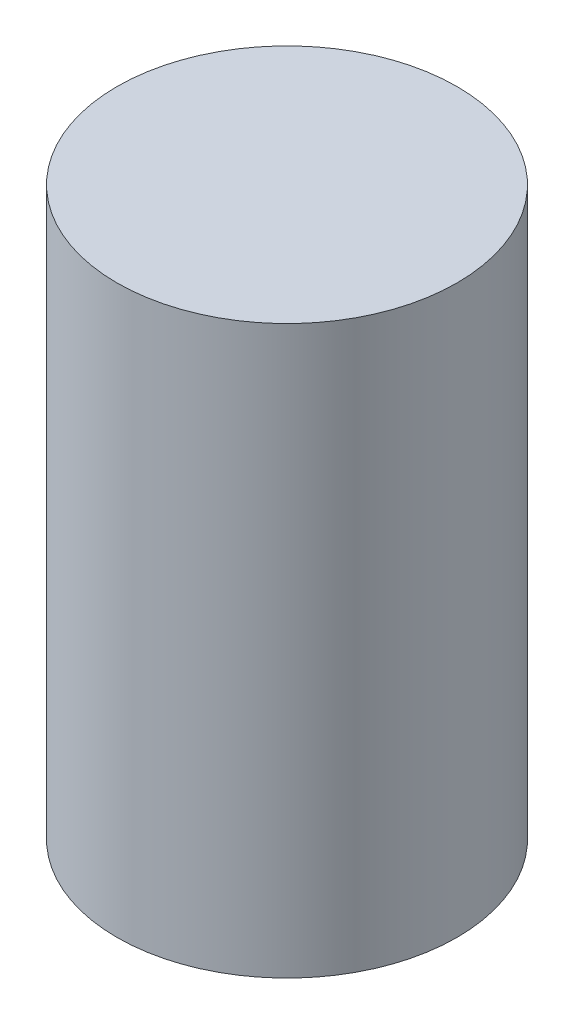
ISO-10303-21;
HEADER;
FILE_DESCRIPTION(('STEP AP214'),'2;1');
FILE_NAME('part.step','',(''),(''),'','','');
FILE_SCHEMA(('AUTOMOTIVE_DESIGN { 1 0 10303 214 1 1 1 1 }'));
ENDSEC;
DATA;
#1=APPLICATION_CONTEXT('core data for automotive mechanical design processes');
#2=APPLICATION_PROTOCOL_DEFINITION('international standard','automotive_design',2000,#1);
#3=PRODUCT_CONTEXT('',#1,'mechanical');
#4=PRODUCT('Part','Part','',(#3));
#5=PRODUCT_RELATED_PRODUCT_CATEGORY('part','',(#4));
#6=PRODUCT_DEFINITION_FORMATION('','',#4);
#7=PRODUCT_DEFINITION_CONTEXT('part definition',#1,'design');
#8=PRODUCT_DEFINITION('design','',#6,#7);
#9=PRODUCT_DEFINITION_SHAPE('','',#8);
#10=(LENGTH_UNIT() NAMED_UNIT(*) SI_UNIT(.MILLI.,.METRE.));
#11=(NAMED_UNIT(*) PLANE_ANGLE_UNIT() SI_UNIT($,.RADIAN.));
#12=(NAMED_UNIT(*) SI_UNIT($,.STERADIAN.) SOLID_ANGLE_UNIT());
#13=UNCERTAINTY_MEASURE_WITH_UNIT(LENGTH_MEASURE(1.E-05),#10,'distance_accuracy_value','');
#14=(GEOMETRIC_REPRESENTATION_CONTEXT(3) GLOBAL_UNCERTAINTY_ASSIGNED_CONTEXT((#13)) GLOBAL_UNIT_ASSIGNED_CONTEXT((#10,
#11,#12)) REPRESENTATION_CONTEXT('',''));
#15=CARTESIAN_POINT('',(0.,0.,0.));
#16=DIRECTION('',(0.,0.,1.));
#17=DIRECTION('',(1.,0.,0.));
#18=AXIS2_PLACEMENT_3D('',#15,#16,#17);
#19=CARTESIAN_POINT('',(0.,2.5,0.));
#20=DIRECTION('',(0.,-1.,0.));
#21=DIRECTION('',(0.,0.,-1.));
#22=AXIS2_PLACEMENT_3D('',#19,#20,#21);
#23=CYLINDRICAL_SURFACE('',#22,1.5);
#24=CARTESIAN_POINT('',(0.,2.5,0.));
#25=DIRECTION('',(0.,1.,0.));
#26=DIRECTION('',(0.,0.,1.));
#27=AXIS2_PLACEMENT_3D('',#24,#25,#26);
#28=CIRCLE('',#27,1.5);
#29=CARTESIAN_POINT('',(0.,2.5,1.5));
#30=VERTEX_POINT('',#29);
#31=EDGE_CURVE('E10',#30,#30,#28,.T.);
#32=ORIENTED_EDGE('',*,*,#31,.F.);
#33=EDGE_LOOP('',(#32));
#34=FACE_BOUND('',#33,.T.);
#35=CARTESIAN_POINT('',(0.,-2.5,0.));
#36=DIRECTION('',(0.,1.,0.));
#37=DIRECTION('',(0.,0.,1.));
#38=AXIS2_PLACEMENT_3D('',#35,#36,#37);
#39=CIRCLE('',#38,1.5);
#40=CARTESIAN_POINT('',(0.,-2.5,1.5));
#41=VERTEX_POINT('',#40);
#42=EDGE_CURVE('E38',#41,#41,#39,.T.);
#43=ORIENTED_EDGE('',*,*,#42,.T.);
#44=EDGE_LOOP('',(#43));
#45=FACE_BOUND('',#44,.T.);
#46=ADVANCED_FACE('F35',(#34,#45),#23,.T.);
#47=CARTESIAN_POINT('',(0.,2.5,0.));
#48=DIRECTION('',(0.,1.,0.));
#49=DIRECTION('',(0.,0.,1.));
#50=AXIS2_PLACEMENT_3D('',#47,#48,#49);
#51=PLANE('',#50);
#52=ORIENTED_EDGE('',*,*,#31,.T.);
#53=EDGE_LOOP('',(#52));
#54=FACE_BOUND('',#53,.T.);
#55=ADVANCED_FACE('F50',(#54),#51,.T.);
#56=CARTESIAN_POINT('',(0.,-2.5,0.));
#57=DIRECTION('',(0.,1.,0.));
#58=DIRECTION('',(0.,0.,1.));
#59=AXIS2_PLACEMENT_3D('',#56,#57,#58);
#60=PLANE('',#59);
#61=ORIENTED_EDGE('',*,*,#42,.F.);
#62=EDGE_LOOP('',(#61));
#63=FACE_BOUND('',#62,.T.);
#64=ADVANCED_FACE('F48',(#63),#60,.F.);
#65=CLOSED_SHELL('',(#46,#55,#64));
#66=MANIFOLD_SOLID_BREP('B2',#65);
#67=ADVANCED_BREP_SHAPE_REPRESENTATION('',(#18,#66),#14);
#68=SHAPE_DEFINITION_REPRESENTATION(#9,#67);
ENDSEC;
END-ISO-10303-21;
